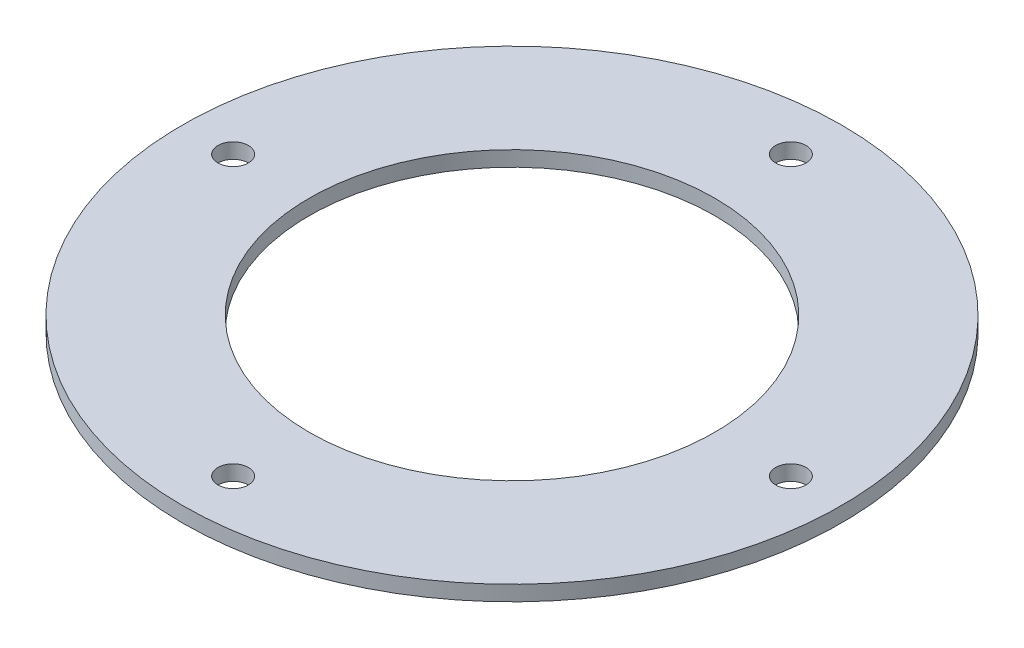
ISO-10303-21;
HEADER;
FILE_DESCRIPTION(('STEP AP214'),'2;1');
FILE_NAME('part.step','',(''),(''),'','','');
FILE_SCHEMA(('AUTOMOTIVE_DESIGN { 1 0 10303 214 1 1 1 1 }'));
ENDSEC;
DATA;
#1=APPLICATION_CONTEXT('core data for automotive mechanical design processes');
#2=APPLICATION_PROTOCOL_DEFINITION('international standard','automotive_design',2000,#1);
#3=PRODUCT_CONTEXT('',#1,'mechanical');
#4=PRODUCT('Part','Part','',(#3));
#5=PRODUCT_RELATED_PRODUCT_CATEGORY('part','',(#4));
#6=PRODUCT_DEFINITION_FORMATION('','',#4);
#7=PRODUCT_DEFINITION_CONTEXT('part definition',#1,'design');
#8=PRODUCT_DEFINITION('design','',#6,#7);
#9=PRODUCT_DEFINITION_SHAPE('','',#8);
#10=(LENGTH_UNIT() NAMED_UNIT(*) SI_UNIT(.MILLI.,.METRE.));
#11=(NAMED_UNIT(*) PLANE_ANGLE_UNIT() SI_UNIT($,.RADIAN.));
#12=(NAMED_UNIT(*) SI_UNIT($,.STERADIAN.) SOLID_ANGLE_UNIT());
#13=UNCERTAINTY_MEASURE_WITH_UNIT(LENGTH_MEASURE(1.E-05),#10,'distance_accuracy_value','');
#14=(GEOMETRIC_REPRESENTATION_CONTEXT(3) GLOBAL_UNCERTAINTY_ASSIGNED_CONTEXT((#13)) GLOBAL_UNIT_ASSIGNED_CONTEXT((#10,
#11,#12)) REPRESENTATION_CONTEXT('',''));
#15=CARTESIAN_POINT('',(0.,0.,0.));
#16=DIRECTION('',(0.,0.,1.));
#17=DIRECTION('',(1.,0.,0.));
#18=AXIS2_PLACEMENT_3D('',#15,#16,#17);
#19=CARTESIAN_POINT('',(0.,3.,0.));
#20=DIRECTION('',(0.,-1.,0.));
#21=DIRECTION('',(0.,0.,-1.));
#22=AXIS2_PLACEMENT_3D('',#19,#20,#21);
#23=CYLINDRICAL_SURFACE('',#22,65.);
#24=CARTESIAN_POINT('',(0.,3.,0.));
#25=DIRECTION('',(0.,1.,0.));
#26=DIRECTION('',(0.,0.,1.));
#27=AXIS2_PLACEMENT_3D('',#24,#25,#26);
#28=CIRCLE('',#27,65.);
#29=CARTESIAN_POINT('',(0.,3.,65.));
#30=VERTEX_POINT('',#29);
#31=EDGE_CURVE('E10',#30,#30,#28,.T.);
#32=ORIENTED_EDGE('',*,*,#31,.F.);
#33=EDGE_LOOP('',(#32));
#34=FACE_BOUND('',#33,.T.);
#35=CARTESIAN_POINT('',(0.,0.,0.));
#36=DIRECTION('',(0.,1.,0.));
#37=DIRECTION('',(0.,0.,1.));
#38=AXIS2_PLACEMENT_3D('',#35,#36,#37);
#39=CIRCLE('',#38,65.);
#40=CARTESIAN_POINT('',(0.,0.,65.));
#41=VERTEX_POINT('',#40);
#42=EDGE_CURVE('E34',#41,#41,#39,.T.);
#43=ORIENTED_EDGE('',*,*,#42,.T.);
#44=EDGE_LOOP('',(#43));
#45=FACE_BOUND('',#44,.T.);
#46=ADVANCED_FACE('F31',(#34,#45),#23,.T.);
#47=CARTESIAN_POINT('',(0.,3.,0.));
#48=DIRECTION('',(0.,1.,0.));
#49=DIRECTION('',(0.,0.,1.));
#50=AXIS2_PLACEMENT_3D('',#47,#48,#49);
#51=PLANE('',#50);
#52=CARTESIAN_POINT('',(0.,3.,0.));
#53=DIRECTION('',(0.,1.,0.));
#54=DIRECTION('',(0.,0.,1.));
#55=AXIS2_PLACEMENT_3D('',#52,#53,#54);
#56=CIRCLE('',#55,40.);
#57=CARTESIAN_POINT('',(0.,3.,40.));
#58=VERTEX_POINT('',#57);
#59=EDGE_CURVE('E67',#58,#58,#56,.T.);
#60=ORIENTED_EDGE('',*,*,#59,.F.);
#61=EDGE_LOOP('',(#60));
#62=FACE_BOUND('',#61,.T.);
#63=CARTESIAN_POINT('',(-55.,3.,1.92031473636372E-13));
#64=DIRECTION('',(0.,1.,0.));
#65=DIRECTION('',(1.,0.,0.));
#66=AXIS2_PLACEMENT_3D('',#63,#64,#65);
#67=CIRCLE('',#66,3.);
#68=CARTESIAN_POINT('',(-52.,3.,1.81557029619843E-13));
#69=VERTEX_POINT('',#68);
#70=EDGE_CURVE('E46',#69,#69,#67,.T.);
#71=ORIENTED_EDGE('',*,*,#70,.F.);
#72=EDGE_LOOP('',(#71));
#73=FACE_BOUND('',#72,.T.);
#74=CARTESIAN_POINT('',(0.,3.,55.));
#75=DIRECTION('',(0.,1.,0.));
#76=DIRECTION('',(0.,0.,-1.));
#77=AXIS2_PLACEMENT_3D('',#74,#75,#76);
#78=CIRCLE('',#77,3.);
#79=CARTESIAN_POINT('',(0.,3.,52.));
#80=VERTEX_POINT('',#79);
#81=EDGE_CURVE('E57',#80,#80,#78,.T.);
#82=ORIENTED_EDGE('',*,*,#81,.F.);
#83=EDGE_LOOP('',(#82));
#84=FACE_BOUND('',#83,.T.);
#85=CARTESIAN_POINT('',(55.,3.,-5.76094420909117E-13));
#86=DIRECTION('',(0.,1.,0.));
#87=DIRECTION('',(-1.,0.,0.));
#88=AXIS2_PLACEMENT_3D('',#85,#86,#87);
#89=CIRCLE('',#88,3.);
#90=CARTESIAN_POINT('',(52.,3.,-5.44671088859529E-13));
#91=VERTEX_POINT('',#90);
#92=EDGE_CURVE('E49',#91,#91,#89,.T.);
#93=ORIENTED_EDGE('',*,*,#92,.F.);
#94=EDGE_LOOP('',(#93));
#95=FACE_BOUND('',#94,.T.);
#96=CARTESIAN_POINT('',(0.,3.,-55.));
#97=DIRECTION('',(0.,1.,0.));
#98=DIRECTION('',(0.,0.,1.));
#99=AXIS2_PLACEMENT_3D('',#96,#97,#98);
#100=CIRCLE('',#99,3.);
#101=CARTESIAN_POINT('',(0.,3.,-52.));
#102=VERTEX_POINT('',#101);
#103=EDGE_CURVE('E43',#102,#102,#100,.T.);
#104=ORIENTED_EDGE('',*,*,#103,.F.);
#105=EDGE_LOOP('',(#104));
#106=FACE_BOUND('',#105,.T.);
#107=ORIENTED_EDGE('',*,*,#31,.T.);
#108=EDGE_LOOP('',(#107));
#109=FACE_BOUND('',#108,.T.);
#110=ADVANCED_FACE('F83',(#62,#73,#84,#95,#106,#109),#51,.T.);
#111=CARTESIAN_POINT('',(0.,0.,0.));
#112=DIRECTION('',(0.,1.,0.));
#113=DIRECTION('',(0.,0.,1.));
#114=AXIS2_PLACEMENT_3D('',#111,#112,#113);
#115=PLANE('',#114);
#116=CARTESIAN_POINT('',(0.,0.,0.));
#117=DIRECTION('',(0.,1.,0.));
#118=DIRECTION('',(0.,0.,1.));
#119=AXIS2_PLACEMENT_3D('',#116,#117,#118);
#120=CIRCLE('',#119,40.);
#121=CARTESIAN_POINT('',(0.,0.,40.));
#122=VERTEX_POINT('',#121);
#123=EDGE_CURVE('E56',#122,#122,#120,.T.);
#124=ORIENTED_EDGE('',*,*,#123,.T.);
#125=EDGE_LOOP('',(#124));
#126=FACE_BOUND('',#125,.T.);
#127=CARTESIAN_POINT('',(-55.,0.,1.92031473636372E-13));
#128=DIRECTION('',(0.,1.,0.));
#129=DIRECTION('',(1.,0.,0.));
#130=AXIS2_PLACEMENT_3D('',#127,#128,#129);
#131=CIRCLE('',#130,3.);
#132=CARTESIAN_POINT('',(-52.,0.,1.81557029619843E-13));
#133=VERTEX_POINT('',#132);
#134=EDGE_CURVE('E60',#133,#133,#131,.T.);
#135=ORIENTED_EDGE('',*,*,#134,.T.);
#136=EDGE_LOOP('',(#135));
#137=FACE_BOUND('',#136,.T.);
#138=CARTESIAN_POINT('',(0.,0.,55.));
#139=DIRECTION('',(0.,1.,0.));
#140=DIRECTION('',(0.,0.,-1.));
#141=AXIS2_PLACEMENT_3D('',#138,#139,#140);
#142=CIRCLE('',#141,3.);
#143=CARTESIAN_POINT('',(0.,0.,52.));
#144=VERTEX_POINT('',#143);
#145=EDGE_CURVE('E52',#144,#144,#142,.T.);
#146=ORIENTED_EDGE('',*,*,#145,.T.);
#147=EDGE_LOOP('',(#146));
#148=FACE_BOUND('',#147,.T.);
#149=CARTESIAN_POINT('',(55.,0.,-5.76094420909117E-13));
#150=DIRECTION('',(0.,1.,0.));
#151=DIRECTION('',(-1.,0.,0.));
#152=AXIS2_PLACEMENT_3D('',#149,#150,#151);
#153=CIRCLE('',#152,3.);
#154=CARTESIAN_POINT('',(52.,0.,-5.44671088859529E-13));
#155=VERTEX_POINT('',#154);
#156=EDGE_CURVE('E53',#155,#155,#153,.T.);
#157=ORIENTED_EDGE('',*,*,#156,.T.);
#158=EDGE_LOOP('',(#157));
#159=FACE_BOUND('',#158,.T.);
#160=CARTESIAN_POINT('',(0.,0.,-55.));
#161=DIRECTION('',(0.,1.,0.));
#162=DIRECTION('',(0.,0.,1.));
#163=AXIS2_PLACEMENT_3D('',#160,#161,#162);
#164=CIRCLE('',#163,3.);
#165=CARTESIAN_POINT('',(0.,0.,-52.));
#166=VERTEX_POINT('',#165);
#167=EDGE_CURVE('E41',#166,#166,#164,.T.);
#168=ORIENTED_EDGE('',*,*,#167,.T.);
#169=EDGE_LOOP('',(#168));
#170=FACE_BOUND('',#169,.T.);
#171=ORIENTED_EDGE('',*,*,#42,.F.);
#172=EDGE_LOOP('',(#171));
#173=FACE_BOUND('',#172,.T.);
#174=ADVANCED_FACE('F73',(#126,#137,#148,#159,#170,#173),#115,.F.);
#175=CARTESIAN_POINT('',(0.,0.,-55.));
#176=DIRECTION('',(0.,1.,0.));
#177=DIRECTION('',(0.,0.,1.));
#178=AXIS2_PLACEMENT_3D('',#175,#176,#177);
#179=CYLINDRICAL_SURFACE('',#178,3.);
#180=ORIENTED_EDGE('',*,*,#167,.F.);
#181=EDGE_LOOP('',(#180));
#182=FACE_BOUND('',#181,.T.);
#183=ORIENTED_EDGE('',*,*,#103,.T.);
#184=EDGE_LOOP('',(#183));
#185=FACE_BOUND('',#184,.T.);
#186=ADVANCED_FACE('F95',(#182,#185),#179,.F.);
#187=CARTESIAN_POINT('',(55.,0.,-5.76094420909117E-13));
#188=DIRECTION('',(0.,1.,0.));
#189=DIRECTION('',(-1.,0.,0.));
#190=AXIS2_PLACEMENT_3D('',#187,#188,#189);
#191=CYLINDRICAL_SURFACE('',#190,3.);
#192=ORIENTED_EDGE('',*,*,#156,.F.);
#193=EDGE_LOOP('',(#192));
#194=FACE_BOUND('',#193,.T.);
#195=ORIENTED_EDGE('',*,*,#92,.T.);
#196=EDGE_LOOP('',(#195));
#197=FACE_BOUND('',#196,.T.);
#198=ADVANCED_FACE('F97',(#194,#197),#191,.F.);
#199=CARTESIAN_POINT('',(0.,0.,55.));
#200=DIRECTION('',(0.,1.,0.));
#201=DIRECTION('',(0.,0.,-1.));
#202=AXIS2_PLACEMENT_3D('',#199,#200,#201);
#203=CYLINDRICAL_SURFACE('',#202,3.);
#204=ORIENTED_EDGE('',*,*,#145,.F.);
#205=EDGE_LOOP('',(#204));
#206=FACE_BOUND('',#205,.T.);
#207=ORIENTED_EDGE('',*,*,#81,.T.);
#208=EDGE_LOOP('',(#207));
#209=FACE_BOUND('',#208,.T.);
#210=ADVANCED_FACE('F104',(#206,#209),#203,.F.);
#211=CARTESIAN_POINT('',(-55.,0.,1.92031473636372E-13));
#212=DIRECTION('',(0.,1.,0.));
#213=DIRECTION('',(1.,0.,0.));
#214=AXIS2_PLACEMENT_3D('',#211,#212,#213);
#215=CYLINDRICAL_SURFACE('',#214,3.);
#216=ORIENTED_EDGE('',*,*,#134,.F.);
#217=EDGE_LOOP('',(#216));
#218=FACE_BOUND('',#217,.T.);
#219=ORIENTED_EDGE('',*,*,#70,.T.);
#220=EDGE_LOOP('',(#219));
#221=FACE_BOUND('',#220,.T.);
#222=ADVANCED_FACE('F79',(#218,#221),#215,.F.);
#223=CARTESIAN_POINT('',(0.,0.,0.));
#224=DIRECTION('',(0.,1.,0.));
#225=DIRECTION('',(0.,0.,1.));
#226=AXIS2_PLACEMENT_3D('',#223,#224,#225);
#227=CYLINDRICAL_SURFACE('',#226,40.);
#228=ORIENTED_EDGE('',*,*,#123,.F.);
#229=EDGE_LOOP('',(#228));
#230=FACE_BOUND('',#229,.T.);
#231=ORIENTED_EDGE('',*,*,#59,.T.);
#232=EDGE_LOOP('',(#231));
#233=FACE_BOUND('',#232,.T.);
#234=ADVANCED_FACE('F76',(#230,#233),#227,.F.);
#235=CLOSED_SHELL('',(#46,#110,#174,#186,#198,#210,#222,#234));
#236=MANIFOLD_SOLID_BREP('B2',#235);
#237=ADVANCED_BREP_SHAPE_REPRESENTATION('',(#18,#236),#14);
#238=SHAPE_DEFINITION_REPRESENTATION(#9,#237);
ENDSEC;
END-ISO-10303-21;
